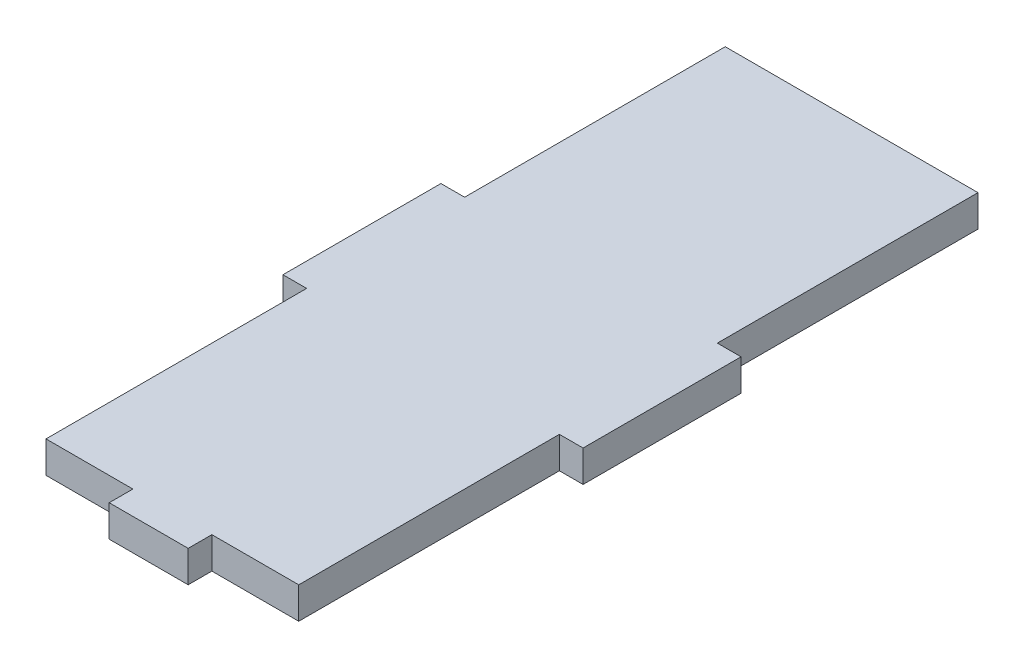
ISO-10303-21;
HEADER;
FILE_DESCRIPTION(('STEP AP214'),'2;1');
FILE_NAME('part.step','',(''),(''),'','','');
FILE_SCHEMA(('AUTOMOTIVE_DESIGN { 1 0 10303 214 1 1 1 1 }'));
ENDSEC;
DATA;
#1=APPLICATION_CONTEXT('core data for automotive mechanical design processes');
#2=APPLICATION_PROTOCOL_DEFINITION('international standard','automotive_design',2000,#1);
#3=PRODUCT_CONTEXT('',#1,'mechanical');
#4=PRODUCT('Part','Part','',(#3));
#5=PRODUCT_RELATED_PRODUCT_CATEGORY('part','',(#4));
#6=PRODUCT_DEFINITION_FORMATION('','',#4);
#7=PRODUCT_DEFINITION_CONTEXT('part definition',#1,'design');
#8=PRODUCT_DEFINITION('design','',#6,#7);
#9=PRODUCT_DEFINITION_SHAPE('','',#8);
#10=(LENGTH_UNIT() NAMED_UNIT(*) SI_UNIT(.MILLI.,.METRE.));
#11=(NAMED_UNIT(*) PLANE_ANGLE_UNIT() SI_UNIT($,.RADIAN.));
#12=(NAMED_UNIT(*) SI_UNIT($,.STERADIAN.) SOLID_ANGLE_UNIT());
#13=UNCERTAINTY_MEASURE_WITH_UNIT(LENGTH_MEASURE(1.E-05),#10,'distance_accuracy_value','');
#14=(GEOMETRIC_REPRESENTATION_CONTEXT(3) GLOBAL_UNCERTAINTY_ASSIGNED_CONTEXT((#13)) GLOBAL_UNIT_ASSIGNED_CONTEXT((#10,
#11,#12)) REPRESENTATION_CONTEXT('',''));
#15=CARTESIAN_POINT('',(0.,0.,0.));
#16=DIRECTION('',(0.,0.,1.));
#17=DIRECTION('',(1.,0.,0.));
#18=AXIS2_PLACEMENT_3D('',#15,#16,#17);
#19=CARTESIAN_POINT('',(-16.,4.,10.));
#20=DIRECTION('',(0.,0.,-1.));
#21=DIRECTION('',(-1.,0.,0.));
#22=AXIS2_PLACEMENT_3D('',#19,#20,#21);
#23=PLANE('',#22);
#24=DIRECTION('',(1.,0.,0.));
#25=VECTOR('',#24,1.);
#26=CARTESIAN_POINT('',(-16.,0.,10.));
#27=LINE('',#26,#25);
#28=CARTESIAN_POINT('',(-19.,0.,10.));
#29=VERTEX_POINT('',#28);
#30=CARTESIAN_POINT('',(-16.,0.,10.));
#31=VERTEX_POINT('',#30);
#32=EDGE_CURVE('E179',#29,#31,#27,.T.);
#33=ORIENTED_EDGE('',*,*,#32,.T.);
#34=DIRECTION('',(0.,-1.,0.));
#35=VECTOR('',#34,1.);
#36=CARTESIAN_POINT('',(-16.,4.,10.));
#37=LINE('',#36,#35);
#38=CARTESIAN_POINT('',(-16.,4.,10.));
#39=VERTEX_POINT('',#38);
#40=EDGE_CURVE('E11',#39,#31,#37,.T.);
#41=ORIENTED_EDGE('',*,*,#40,.F.);
#42=DIRECTION('',(1.,0.,0.));
#43=VECTOR('',#42,1.);
#44=CARTESIAN_POINT('',(-16.,4.,10.));
#45=LINE('',#44,#43);
#46=CARTESIAN_POINT('',(-19.,4.,10.));
#47=VERTEX_POINT('',#46);
#48=EDGE_CURVE('E209',#47,#39,#45,.T.);
#49=ORIENTED_EDGE('',*,*,#48,.F.);
#50=DIRECTION('',(0.,-1.,0.));
#51=VECTOR('',#50,1.);
#52=CARTESIAN_POINT('',(-19.,4.,10.));
#53=LINE('',#52,#51);
#54=EDGE_CURVE('E175',#47,#29,#53,.T.);
#55=ORIENTED_EDGE('',*,*,#54,.T.);
#56=EDGE_LOOP('',(#33,#41,#49,#55));
#57=FACE_BOUND('',#56,.T.);
#58=ADVANCED_FACE('F35',(#57),#23,.F.);
#59=CARTESIAN_POINT('',(-16.,4.,10.));
#60=DIRECTION('',(1.,0.,0.));
#61=DIRECTION('',(0.,0.,-1.));
#62=AXIS2_PLACEMENT_3D('',#59,#60,#61);
#63=PLANE('',#62);
#64=DIRECTION('',(0.,0.,1.));
#65=VECTOR('',#64,1.);
#66=CARTESIAN_POINT('',(-16.,0.,10.));
#67=LINE('',#66,#65);
#68=CARTESIAN_POINT('',(-16.,0.,43.));
#69=VERTEX_POINT('',#68);
#70=EDGE_CURVE('E182',#31,#69,#67,.T.);
#71=ORIENTED_EDGE('',*,*,#70,.T.);
#72=DIRECTION('',(0.,-1.,0.));
#73=VECTOR('',#72,1.);
#74=CARTESIAN_POINT('',(-16.,4.,43.));
#75=LINE('',#74,#73);
#76=CARTESIAN_POINT('',(-16.,4.,43.));
#77=VERTEX_POINT('',#76);
#78=EDGE_CURVE('E43',#77,#69,#75,.T.);
#79=ORIENTED_EDGE('',*,*,#78,.F.);
#80=DIRECTION('',(0.,0.,1.));
#81=VECTOR('',#80,1.);
#82=CARTESIAN_POINT('',(-16.,4.,10.));
#83=LINE('',#82,#81);
#84=EDGE_CURVE('E118',#39,#77,#83,.T.);
#85=ORIENTED_EDGE('',*,*,#84,.F.);
#86=ORIENTED_EDGE('',*,*,#40,.T.);
#87=EDGE_LOOP('',(#71,#79,#85,#86));
#88=FACE_BOUND('',#87,.T.);
#89=ADVANCED_FACE('F307',(#88),#63,.F.);
#90=CARTESIAN_POINT('',(-4.99999999999998,4.,43.));
#91=DIRECTION('',(0.,0.,-1.));
#92=DIRECTION('',(-1.,0.,0.));
#93=AXIS2_PLACEMENT_3D('',#90,#91,#92);
#94=PLANE('',#93);
#95=DIRECTION('',(1.,0.,0.));
#96=VECTOR('',#95,1.);
#97=CARTESIAN_POINT('',(-4.99999999999998,0.,43.));
#98=LINE('',#97,#96);
#99=CARTESIAN_POINT('',(-4.99999999999998,0.,43.));
#100=VERTEX_POINT('',#99);
#101=EDGE_CURVE('E184',#69,#100,#98,.T.);
#102=ORIENTED_EDGE('',*,*,#101,.T.);
#103=DIRECTION('',(0.,-1.,0.));
#104=VECTOR('',#103,1.);
#105=CARTESIAN_POINT('',(-4.99999999999998,4.,43.));
#106=LINE('',#105,#104);
#107=CARTESIAN_POINT('',(-4.99999999999998,4.,43.));
#108=VERTEX_POINT('',#107);
#109=EDGE_CURVE('E240',#108,#100,#106,.T.);
#110=ORIENTED_EDGE('',*,*,#109,.F.);
#111=DIRECTION('',(1.,0.,0.));
#112=VECTOR('',#111,1.);
#113=CARTESIAN_POINT('',(-4.99999999999998,4.,43.));
#114=LINE('',#113,#112);
#115=EDGE_CURVE('E248',#77,#108,#114,.T.);
#116=ORIENTED_EDGE('',*,*,#115,.F.);
#117=ORIENTED_EDGE('',*,*,#78,.T.);
#118=EDGE_LOOP('',(#102,#110,#116,#117));
#119=FACE_BOUND('',#118,.T.);
#120=ADVANCED_FACE('F246',(#119),#94,.F.);
#121=CARTESIAN_POINT('',(-4.99999999999999,4.,46.));
#122=DIRECTION('',(1.,0.,0.));
#123=DIRECTION('',(0.,0.,-1.));
#124=AXIS2_PLACEMENT_3D('',#121,#122,#123);
#125=PLANE('',#124);
#126=DIRECTION('',(0.,0.,1.));
#127=VECTOR('',#126,1.);
#128=CARTESIAN_POINT('',(-4.99999999999999,0.,46.));
#129=LINE('',#128,#127);
#130=CARTESIAN_POINT('',(-4.99999999999999,0.,46.));
#131=VERTEX_POINT('',#130);
#132=EDGE_CURVE('E186',#100,#131,#129,.T.);
#133=ORIENTED_EDGE('',*,*,#132,.T.);
#134=DIRECTION('',(0.,-1.,0.));
#135=VECTOR('',#134,1.);
#136=CARTESIAN_POINT('',(-4.99999999999999,4.,46.));
#137=LINE('',#136,#135);
#138=CARTESIAN_POINT('',(-4.99999999999999,4.,46.));
#139=VERTEX_POINT('',#138);
#140=EDGE_CURVE('E237',#139,#131,#137,.T.);
#141=ORIENTED_EDGE('',*,*,#140,.F.);
#142=DIRECTION('',(0.,0.,1.));
#143=VECTOR('',#142,1.);
#144=CARTESIAN_POINT('',(-4.99999999999999,4.,46.));
#145=LINE('',#144,#143);
#146=EDGE_CURVE('E266',#108,#139,#145,.T.);
#147=ORIENTED_EDGE('',*,*,#146,.F.);
#148=ORIENTED_EDGE('',*,*,#109,.T.);
#149=EDGE_LOOP('',(#133,#141,#147,#148));
#150=FACE_BOUND('',#149,.T.);
#151=ADVANCED_FACE('F257',(#150),#125,.F.);
#152=CARTESIAN_POINT('',(5.00000000000001,4.,46.));
#153=DIRECTION('',(0.,0.,-1.));
#154=DIRECTION('',(-1.,0.,0.));
#155=AXIS2_PLACEMENT_3D('',#152,#153,#154);
#156=PLANE('',#155);
#157=DIRECTION('',(1.,0.,0.));
#158=VECTOR('',#157,1.);
#159=CARTESIAN_POINT('',(5.00000000000001,0.,46.));
#160=LINE('',#159,#158);
#161=CARTESIAN_POINT('',(5.00000000000001,0.,46.));
#162=VERTEX_POINT('',#161);
#163=EDGE_CURVE('E188',#131,#162,#160,.T.);
#164=ORIENTED_EDGE('',*,*,#163,.T.);
#165=DIRECTION('',(0.,-1.,0.));
#166=VECTOR('',#165,1.);
#167=CARTESIAN_POINT('',(5.00000000000001,4.,46.));
#168=LINE('',#167,#166);
#169=CARTESIAN_POINT('',(5.00000000000001,4.,46.));
#170=VERTEX_POINT('',#169);
#171=EDGE_CURVE('E234',#170,#162,#168,.T.);
#172=ORIENTED_EDGE('',*,*,#171,.F.);
#173=DIRECTION('',(1.,0.,0.));
#174=VECTOR('',#173,1.);
#175=CARTESIAN_POINT('',(5.00000000000001,4.,46.));
#176=LINE('',#175,#174);
#177=EDGE_CURVE('E263',#139,#170,#176,.T.);
#178=ORIENTED_EDGE('',*,*,#177,.F.);
#179=ORIENTED_EDGE('',*,*,#140,.T.);
#180=EDGE_LOOP('',(#164,#172,#178,#179));
#181=FACE_BOUND('',#180,.T.);
#182=ADVANCED_FACE('F261',(#181),#156,.F.);
#183=CARTESIAN_POINT('',(4.99999999999998,4.,43.));
#184=DIRECTION('',(-1.,0.,0.));
#185=DIRECTION('',(0.,0.,1.));
#186=AXIS2_PLACEMENT_3D('',#183,#184,#185);
#187=PLANE('',#186);
#188=DIRECTION('',(0.,0.,-1.));
#189=VECTOR('',#188,1.);
#190=CARTESIAN_POINT('',(4.99999999999998,0.,43.));
#191=LINE('',#190,#189);
#192=CARTESIAN_POINT('',(4.99999999999998,0.,43.));
#193=VERTEX_POINT('',#192);
#194=EDGE_CURVE('E190',#162,#193,#191,.T.);
#195=ORIENTED_EDGE('',*,*,#194,.T.);
#196=DIRECTION('',(0.,-1.,0.));
#197=VECTOR('',#196,1.);
#198=CARTESIAN_POINT('',(4.99999999999998,4.,43.));
#199=LINE('',#198,#197);
#200=CARTESIAN_POINT('',(4.99999999999998,4.,43.));
#201=VERTEX_POINT('',#200);
#202=EDGE_CURVE('E231',#201,#193,#199,.T.);
#203=ORIENTED_EDGE('',*,*,#202,.F.);
#204=DIRECTION('',(0.,0.,-1.));
#205=VECTOR('',#204,1.);
#206=CARTESIAN_POINT('',(4.99999999999998,4.,43.));
#207=LINE('',#206,#205);
#208=EDGE_CURVE('E265',#170,#201,#207,.T.);
#209=ORIENTED_EDGE('',*,*,#208,.F.);
#210=ORIENTED_EDGE('',*,*,#171,.T.);
#211=EDGE_LOOP('',(#195,#203,#209,#210));
#212=FACE_BOUND('',#211,.T.);
#213=ADVANCED_FACE('F320',(#212),#187,.F.);
#214=CARTESIAN_POINT('',(16.,4.,43.));
#215=DIRECTION('',(0.,0.,-1.));
#216=DIRECTION('',(-1.,0.,0.));
#217=AXIS2_PLACEMENT_3D('',#214,#215,#216);
#218=PLANE('',#217);
#219=DIRECTION('',(1.,0.,0.));
#220=VECTOR('',#219,1.);
#221=CARTESIAN_POINT('',(16.,0.,43.));
#222=LINE('',#221,#220);
#223=CARTESIAN_POINT('',(16.,0.,43.));
#224=VERTEX_POINT('',#223);
#225=EDGE_CURVE('E192',#193,#224,#222,.T.);
#226=ORIENTED_EDGE('',*,*,#225,.T.);
#227=DIRECTION('',(0.,-1.,0.));
#228=VECTOR('',#227,1.);
#229=CARTESIAN_POINT('',(16.,4.,43.));
#230=LINE('',#229,#228);
#231=CARTESIAN_POINT('',(16.,4.,43.));
#232=VERTEX_POINT('',#231);
#233=EDGE_CURVE('E228',#232,#224,#230,.T.);
#234=ORIENTED_EDGE('',*,*,#233,.F.);
#235=DIRECTION('',(1.,0.,0.));
#236=VECTOR('',#235,1.);
#237=CARTESIAN_POINT('',(16.,4.,43.));
#238=LINE('',#237,#236);
#239=EDGE_CURVE('E268',#201,#232,#238,.T.);
#240=ORIENTED_EDGE('',*,*,#239,.F.);
#241=ORIENTED_EDGE('',*,*,#202,.T.);
#242=EDGE_LOOP('',(#226,#234,#240,#241));
#243=FACE_BOUND('',#242,.T.);
#244=ADVANCED_FACE('F323',(#243),#218,.F.);
#245=CARTESIAN_POINT('',(16.,4.,10.));
#246=DIRECTION('',(-1.,0.,0.));
#247=DIRECTION('',(0.,0.,1.));
#248=AXIS2_PLACEMENT_3D('',#245,#246,#247);
#249=PLANE('',#248);
#250=DIRECTION('',(0.,0.,-1.));
#251=VECTOR('',#250,1.);
#252=CARTESIAN_POINT('',(16.,0.,10.));
#253=LINE('',#252,#251);
#254=CARTESIAN_POINT('',(16.,0.,10.));
#255=VERTEX_POINT('',#254);
#256=EDGE_CURVE('E194',#224,#255,#253,.T.);
#257=ORIENTED_EDGE('',*,*,#256,.T.);
#258=DIRECTION('',(0.,-1.,0.));
#259=VECTOR('',#258,1.);
#260=CARTESIAN_POINT('',(16.,4.,10.));
#261=LINE('',#260,#259);
#262=CARTESIAN_POINT('',(16.,4.,10.));
#263=VERTEX_POINT('',#262);
#264=EDGE_CURVE('E225',#263,#255,#261,.T.);
#265=ORIENTED_EDGE('',*,*,#264,.F.);
#266=DIRECTION('',(0.,0.,-1.));
#267=VECTOR('',#266,1.);
#268=CARTESIAN_POINT('',(16.,4.,10.));
#269=LINE('',#268,#267);
#270=EDGE_CURVE('E274',#232,#263,#269,.T.);
#271=ORIENTED_EDGE('',*,*,#270,.F.);
#272=ORIENTED_EDGE('',*,*,#233,.T.);
#273=EDGE_LOOP('',(#257,#265,#271,#272));
#274=FACE_BOUND('',#273,.T.);
#275=ADVANCED_FACE('F327',(#274),#249,.F.);
#276=CARTESIAN_POINT('',(19.,4.,10.));
#277=DIRECTION('',(0.,0.,-1.));
#278=DIRECTION('',(-1.,0.,0.));
#279=AXIS2_PLACEMENT_3D('',#276,#277,#278);
#280=PLANE('',#279);
#281=DIRECTION('',(1.,0.,0.));
#282=VECTOR('',#281,1.);
#283=CARTESIAN_POINT('',(19.,0.,10.));
#284=LINE('',#283,#282);
#285=CARTESIAN_POINT('',(19.,0.,10.));
#286=VERTEX_POINT('',#285);
#287=EDGE_CURVE('E196',#255,#286,#284,.T.);
#288=ORIENTED_EDGE('',*,*,#287,.T.);
#289=DIRECTION('',(0.,-1.,0.));
#290=VECTOR('',#289,1.);
#291=CARTESIAN_POINT('',(19.,4.,10.));
#292=LINE('',#291,#290);
#293=CARTESIAN_POINT('',(19.,4.,10.));
#294=VERTEX_POINT('',#293);
#295=EDGE_CURVE('E222',#294,#286,#292,.T.);
#296=ORIENTED_EDGE('',*,*,#295,.F.);
#297=DIRECTION('',(1.,0.,0.));
#298=VECTOR('',#297,1.);
#299=CARTESIAN_POINT('',(19.,4.,10.));
#300=LINE('',#299,#298);
#301=EDGE_CURVE('E276',#263,#294,#300,.T.);
#302=ORIENTED_EDGE('',*,*,#301,.F.);
#303=ORIENTED_EDGE('',*,*,#264,.T.);
#304=EDGE_LOOP('',(#288,#296,#302,#303));
#305=FACE_BOUND('',#304,.T.);
#306=ADVANCED_FACE('F331',(#305),#280,.F.);
#307=CARTESIAN_POINT('',(19.,4.,-10.));
#308=DIRECTION('',(-1.,0.,0.));
#309=DIRECTION('',(0.,0.,1.));
#310=AXIS2_PLACEMENT_3D('',#307,#308,#309);
#311=PLANE('',#310);
#312=DIRECTION('',(0.,0.,-1.));
#313=VECTOR('',#312,1.);
#314=CARTESIAN_POINT('',(19.,0.,-10.));
#315=LINE('',#314,#313);
#316=CARTESIAN_POINT('',(19.,0.,-10.));
#317=VERTEX_POINT('',#316);
#318=EDGE_CURVE('E198',#286,#317,#315,.T.);
#319=ORIENTED_EDGE('',*,*,#318,.T.);
#320=DIRECTION('',(0.,-1.,0.));
#321=VECTOR('',#320,1.);
#322=CARTESIAN_POINT('',(19.,4.,-10.));
#323=LINE('',#322,#321);
#324=CARTESIAN_POINT('',(19.,4.,-10.));
#325=VERTEX_POINT('',#324);
#326=EDGE_CURVE('E219',#325,#317,#323,.T.);
#327=ORIENTED_EDGE('',*,*,#326,.F.);
#328=DIRECTION('',(0.,0.,-1.));
#329=VECTOR('',#328,1.);
#330=CARTESIAN_POINT('',(19.,4.,-10.));
#331=LINE('',#330,#329);
#332=EDGE_CURVE('E278',#294,#325,#331,.T.);
#333=ORIENTED_EDGE('',*,*,#332,.F.);
#334=ORIENTED_EDGE('',*,*,#295,.T.);
#335=EDGE_LOOP('',(#319,#327,#333,#334));
#336=FACE_BOUND('',#335,.T.);
#337=ADVANCED_FACE('F335',(#336),#311,.F.);
#338=CARTESIAN_POINT('',(16.,4.,-10.));
#339=DIRECTION('',(0.,0.,1.));
#340=DIRECTION('',(1.,0.,0.));
#341=AXIS2_PLACEMENT_3D('',#338,#339,#340);
#342=PLANE('',#341);
#343=DIRECTION('',(-1.,0.,0.));
#344=VECTOR('',#343,1.);
#345=CARTESIAN_POINT('',(16.,0.,-10.));
#346=LINE('',#345,#344);
#347=CARTESIAN_POINT('',(16.,0.,-10.));
#348=VERTEX_POINT('',#347);
#349=EDGE_CURVE('E200',#317,#348,#346,.T.);
#350=ORIENTED_EDGE('',*,*,#349,.T.);
#351=DIRECTION('',(0.,-1.,0.));
#352=VECTOR('',#351,1.);
#353=CARTESIAN_POINT('',(16.,4.,-10.));
#354=LINE('',#353,#352);
#355=CARTESIAN_POINT('',(16.,4.,-10.));
#356=VERTEX_POINT('',#355);
#357=EDGE_CURVE('E216',#356,#348,#354,.T.);
#358=ORIENTED_EDGE('',*,*,#357,.F.);
#359=DIRECTION('',(-1.,0.,0.));
#360=VECTOR('',#359,1.);
#361=CARTESIAN_POINT('',(16.,4.,-10.));
#362=LINE('',#361,#360);
#363=EDGE_CURVE('E280',#325,#356,#362,.T.);
#364=ORIENTED_EDGE('',*,*,#363,.F.);
#365=ORIENTED_EDGE('',*,*,#326,.T.);
#366=EDGE_LOOP('',(#350,#358,#364,#365));
#367=FACE_BOUND('',#366,.T.);
#368=ADVANCED_FACE('F339',(#367),#342,.F.);
#369=CARTESIAN_POINT('',(16.,4.,-43.));
#370=DIRECTION('',(-1.,0.,0.));
#371=DIRECTION('',(0.,0.,1.));
#372=AXIS2_PLACEMENT_3D('',#369,#370,#371);
#373=PLANE('',#372);
#374=DIRECTION('',(0.,0.,-1.));
#375=VECTOR('',#374,1.);
#376=CARTESIAN_POINT('',(16.,0.,-43.));
#377=LINE('',#376,#375);
#378=CARTESIAN_POINT('',(16.,0.,-43.));
#379=VERTEX_POINT('',#378);
#380=EDGE_CURVE('E202',#348,#379,#377,.T.);
#381=ORIENTED_EDGE('',*,*,#380,.T.);
#382=DIRECTION('',(0.,-1.,0.));
#383=VECTOR('',#382,1.);
#384=CARTESIAN_POINT('',(16.,4.,-43.));
#385=LINE('',#384,#383);
#386=CARTESIAN_POINT('',(16.,4.,-43.));
#387=VERTEX_POINT('',#386);
#388=EDGE_CURVE('E213',#387,#379,#385,.T.);
#389=ORIENTED_EDGE('',*,*,#388,.F.);
#390=DIRECTION('',(0.,0.,-1.));
#391=VECTOR('',#390,1.);
#392=CARTESIAN_POINT('',(16.,4.,-43.));
#393=LINE('',#392,#391);
#394=EDGE_CURVE('E282',#356,#387,#393,.T.);
#395=ORIENTED_EDGE('',*,*,#394,.F.);
#396=ORIENTED_EDGE('',*,*,#357,.T.);
#397=EDGE_LOOP('',(#381,#389,#395,#396));
#398=FACE_BOUND('',#397,.T.);
#399=ADVANCED_FACE('F288',(#398),#373,.F.);
#400=CARTESIAN_POINT('',(-16.,4.,-43.));
#401=DIRECTION('',(0.,0.,1.));
#402=DIRECTION('',(1.,0.,0.));
#403=AXIS2_PLACEMENT_3D('',#400,#401,#402);
#404=PLANE('',#403);
#405=DIRECTION('',(-1.,0.,0.));
#406=VECTOR('',#405,1.);
#407=CARTESIAN_POINT('',(-16.,0.,-43.));
#408=LINE('',#407,#406);
#409=CARTESIAN_POINT('',(-16.,0.,-43.));
#410=VERTEX_POINT('',#409);
#411=EDGE_CURVE('E204',#379,#410,#408,.T.);
#412=ORIENTED_EDGE('',*,*,#411,.T.);
#413=DIRECTION('',(0.,-1.,0.));
#414=VECTOR('',#413,1.);
#415=CARTESIAN_POINT('',(-16.,4.,-43.));
#416=LINE('',#415,#414);
#417=CARTESIAN_POINT('',(-16.,4.,-43.));
#418=VERTEX_POINT('',#417);
#419=EDGE_CURVE('E170',#418,#410,#416,.T.);
#420=ORIENTED_EDGE('',*,*,#419,.F.);
#421=DIRECTION('',(-1.,0.,0.));
#422=VECTOR('',#421,1.);
#423=CARTESIAN_POINT('',(-16.,4.,-43.));
#424=LINE('',#423,#422);
#425=EDGE_CURVE('E161',#387,#418,#424,.T.);
#426=ORIENTED_EDGE('',*,*,#425,.F.);
#427=ORIENTED_EDGE('',*,*,#388,.T.);
#428=EDGE_LOOP('',(#412,#420,#426,#427));
#429=FACE_BOUND('',#428,.T.);
#430=ADVANCED_FACE('F292',(#429),#404,.F.);
#431=CARTESIAN_POINT('',(-16.,4.,-10.));
#432=DIRECTION('',(1.,0.,0.));
#433=DIRECTION('',(0.,0.,-1.));
#434=AXIS2_PLACEMENT_3D('',#431,#432,#433);
#435=PLANE('',#434);
#436=DIRECTION('',(0.,0.,1.));
#437=VECTOR('',#436,1.);
#438=CARTESIAN_POINT('',(-16.,0.,-10.));
#439=LINE('',#438,#437);
#440=CARTESIAN_POINT('',(-16.,0.,-10.));
#441=VERTEX_POINT('',#440);
#442=EDGE_CURVE('E169',#410,#441,#439,.T.);
#443=ORIENTED_EDGE('',*,*,#442,.T.);
#444=DIRECTION('',(0.,-1.,0.));
#445=VECTOR('',#444,1.);
#446=CARTESIAN_POINT('',(-16.,4.,-10.));
#447=LINE('',#446,#445);
#448=CARTESIAN_POINT('',(-16.,4.,-10.));
#449=VERTEX_POINT('',#448);
#450=EDGE_CURVE('E166',#449,#441,#447,.T.);
#451=ORIENTED_EDGE('',*,*,#450,.F.);
#452=DIRECTION('',(0.,0.,1.));
#453=VECTOR('',#452,1.);
#454=CARTESIAN_POINT('',(-16.,4.,-10.));
#455=LINE('',#454,#453);
#456=EDGE_CURVE('E155',#418,#449,#455,.T.);
#457=ORIENTED_EDGE('',*,*,#456,.F.);
#458=ORIENTED_EDGE('',*,*,#419,.T.);
#459=EDGE_LOOP('',(#443,#451,#457,#458));
#460=FACE_BOUND('',#459,.T.);
#461=ADVANCED_FACE('F167',(#460),#435,.F.);
#462=CARTESIAN_POINT('',(-19.,4.,-10.));
#463=DIRECTION('',(0.,0.,1.));
#464=DIRECTION('',(1.,0.,0.));
#465=AXIS2_PLACEMENT_3D('',#462,#463,#464);
#466=PLANE('',#465);
#467=DIRECTION('',(-1.,0.,0.));
#468=VECTOR('',#467,1.);
#469=CARTESIAN_POINT('',(-19.,0.,-10.));
#470=LINE('',#469,#468);
#471=CARTESIAN_POINT('',(-19.,0.,-10.));
#472=VERTEX_POINT('',#471);
#473=EDGE_CURVE('E104',#441,#472,#470,.T.);
#474=ORIENTED_EDGE('',*,*,#473,.T.);
#475=DIRECTION('',(0.,-1.,0.));
#476=VECTOR('',#475,1.);
#477=CARTESIAN_POINT('',(-19.,4.,-10.));
#478=LINE('',#477,#476);
#479=CARTESIAN_POINT('',(-19.,4.,-10.));
#480=VERTEX_POINT('',#479);
#481=EDGE_CURVE('E171',#480,#472,#478,.T.);
#482=ORIENTED_EDGE('',*,*,#481,.F.);
#483=DIRECTION('',(-1.,0.,0.));
#484=VECTOR('',#483,1.);
#485=CARTESIAN_POINT('',(-19.,4.,-10.));
#486=LINE('',#485,#484);
#487=EDGE_CURVE('E159',#449,#480,#486,.T.);
#488=ORIENTED_EDGE('',*,*,#487,.F.);
#489=ORIENTED_EDGE('',*,*,#450,.T.);
#490=EDGE_LOOP('',(#474,#482,#488,#489));
#491=FACE_BOUND('',#490,.T.);
#492=ADVANCED_FACE('F173',(#491),#466,.F.);
#493=CARTESIAN_POINT('',(-19.,4.,10.));
#494=DIRECTION('',(1.,0.,0.));
#495=DIRECTION('',(0.,0.,-1.));
#496=AXIS2_PLACEMENT_3D('',#493,#494,#495);
#497=PLANE('',#496);
#498=DIRECTION('',(0.,0.,1.));
#499=VECTOR('',#498,1.);
#500=CARTESIAN_POINT('',(-19.,0.,10.));
#501=LINE('',#500,#499);
#502=EDGE_CURVE('E110',#472,#29,#501,.T.);
#503=ORIENTED_EDGE('',*,*,#502,.T.);
#504=ORIENTED_EDGE('',*,*,#54,.F.);
#505=DIRECTION('',(0.,0.,1.));
#506=VECTOR('',#505,1.);
#507=CARTESIAN_POINT('',(-19.,4.,10.));
#508=LINE('',#507,#506);
#509=EDGE_CURVE('E51',#480,#47,#508,.T.);
#510=ORIENTED_EDGE('',*,*,#509,.F.);
#511=ORIENTED_EDGE('',*,*,#481,.T.);
#512=EDGE_LOOP('',(#503,#504,#510,#511));
#513=FACE_BOUND('',#512,.T.);
#514=ADVANCED_FACE('F296',(#513),#497,.F.);
#515=CARTESIAN_POINT('',(0.,4.,0.));
#516=DIRECTION('',(0.,-1.,0.));
#517=DIRECTION('',(0.,0.,-1.));
#518=AXIS2_PLACEMENT_3D('',#515,#516,#517);
#519=PLANE('',#518);
#520=ORIENTED_EDGE('',*,*,#48,.T.);
#521=ORIENTED_EDGE('',*,*,#84,.T.);
#522=ORIENTED_EDGE('',*,*,#115,.T.);
#523=ORIENTED_EDGE('',*,*,#146,.T.);
#524=ORIENTED_EDGE('',*,*,#177,.T.);
#525=ORIENTED_EDGE('',*,*,#208,.T.);
#526=ORIENTED_EDGE('',*,*,#239,.T.);
#527=ORIENTED_EDGE('',*,*,#270,.T.);
#528=ORIENTED_EDGE('',*,*,#301,.T.);
#529=ORIENTED_EDGE('',*,*,#332,.T.);
#530=ORIENTED_EDGE('',*,*,#363,.T.);
#531=ORIENTED_EDGE('',*,*,#394,.T.);
#532=ORIENTED_EDGE('',*,*,#425,.T.);
#533=ORIENTED_EDGE('',*,*,#456,.T.);
#534=ORIENTED_EDGE('',*,*,#487,.T.);
#535=ORIENTED_EDGE('',*,*,#509,.T.);
#536=EDGE_LOOP('',(#520,#521,#522,#523,#524,#525,#526,#527,#528,#529,#530,#531,#532,#533,#534,#535));
#537=FACE_BOUND('',#536,.T.);
#538=ADVANCED_FACE('F157',(#537),#519,.F.);
#539=CARTESIAN_POINT('',(0.,0.,0.));
#540=DIRECTION('',(0.,-1.,0.));
#541=DIRECTION('',(0.,0.,-1.));
#542=AXIS2_PLACEMENT_3D('',#539,#540,#541);
#543=PLANE('',#542);
#544=ORIENTED_EDGE('',*,*,#32,.F.);
#545=ORIENTED_EDGE('',*,*,#502,.F.);
#546=ORIENTED_EDGE('',*,*,#473,.F.);
#547=ORIENTED_EDGE('',*,*,#442,.F.);
#548=ORIENTED_EDGE('',*,*,#411,.F.);
#549=ORIENTED_EDGE('',*,*,#380,.F.);
#550=ORIENTED_EDGE('',*,*,#349,.F.);
#551=ORIENTED_EDGE('',*,*,#318,.F.);
#552=ORIENTED_EDGE('',*,*,#287,.F.);
#553=ORIENTED_EDGE('',*,*,#256,.F.);
#554=ORIENTED_EDGE('',*,*,#225,.F.);
#555=ORIENTED_EDGE('',*,*,#194,.F.);
#556=ORIENTED_EDGE('',*,*,#163,.F.);
#557=ORIENTED_EDGE('',*,*,#132,.F.);
#558=ORIENTED_EDGE('',*,*,#101,.F.);
#559=ORIENTED_EDGE('',*,*,#70,.F.);
#560=EDGE_LOOP('',(#544,#545,#546,#547,#548,#549,#550,#551,#552,#553,#554,#555,#556,#557,#558,#559));
#561=FACE_BOUND('',#560,.T.);
#562=ADVANCED_FACE('F252',(#561),#543,.T.);
#563=CLOSED_SHELL('',(#58,#89,#120,#151,#182,#213,#244,#275,#306,#337,#368,#399,#430,#461,#492,
#514,#538,#562));
#564=MANIFOLD_SOLID_BREP('B2',#563);
#565=ADVANCED_BREP_SHAPE_REPRESENTATION('',(#18,#564),#14);
#566=SHAPE_DEFINITION_REPRESENTATION(#9,#565);
ENDSEC;
END-ISO-10303-21;
